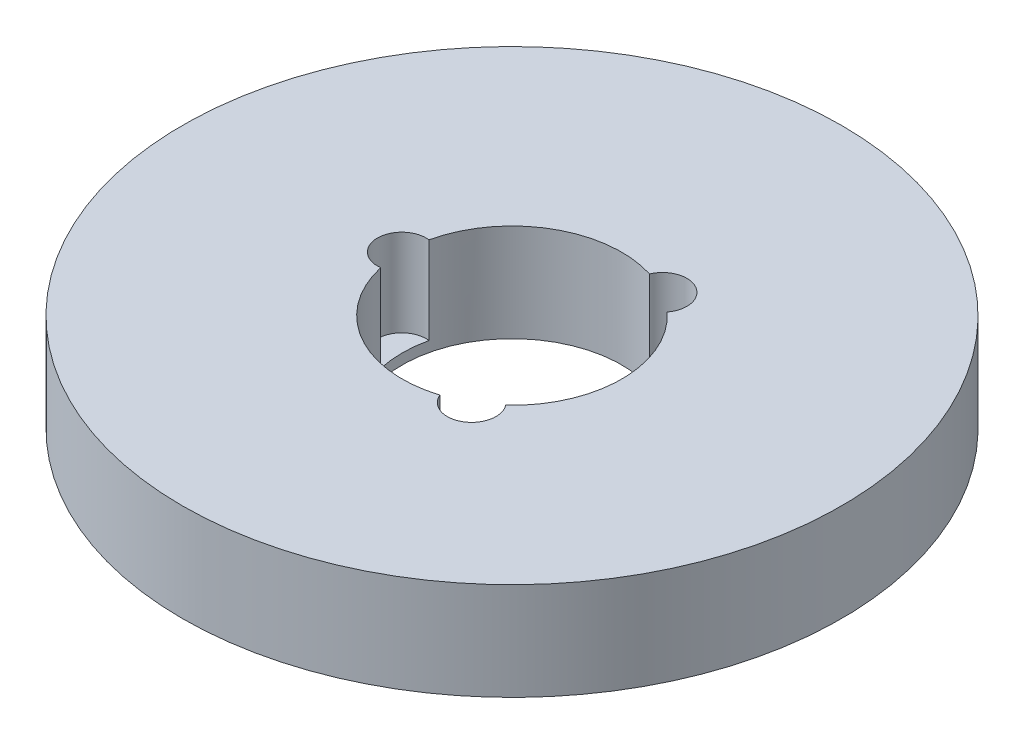
ISO-10303-21;
HEADER;
FILE_DESCRIPTION(('STEP AP214'),'2;1');
FILE_NAME('part.step','',(''),(''),'','','');
FILE_SCHEMA(('AUTOMOTIVE_DESIGN { 1 0 10303 214 1 1 1 1 }'));
ENDSEC;
DATA;
#1=APPLICATION_CONTEXT('core data for automotive mechanical design processes');
#2=APPLICATION_PROTOCOL_DEFINITION('international standard','automotive_design',2000,#1);
#3=PRODUCT_CONTEXT('',#1,'mechanical');
#4=PRODUCT('Part','Part','',(#3));
#5=PRODUCT_RELATED_PRODUCT_CATEGORY('part','',(#4));
#6=PRODUCT_DEFINITION_FORMATION('','',#4);
#7=PRODUCT_DEFINITION_CONTEXT('part definition',#1,'design');
#8=PRODUCT_DEFINITION('design','',#6,#7);
#9=PRODUCT_DEFINITION_SHAPE('','',#8);
#10=(LENGTH_UNIT() NAMED_UNIT(*) SI_UNIT(.MILLI.,.METRE.));
#11=(NAMED_UNIT(*) PLANE_ANGLE_UNIT() SI_UNIT($,.RADIAN.));
#12=(NAMED_UNIT(*) SI_UNIT($,.STERADIAN.) SOLID_ANGLE_UNIT());
#13=UNCERTAINTY_MEASURE_WITH_UNIT(LENGTH_MEASURE(1.E-05),#10,'distance_accuracy_value','');
#14=(GEOMETRIC_REPRESENTATION_CONTEXT(3) GLOBAL_UNCERTAINTY_ASSIGNED_CONTEXT((#13)) GLOBAL_UNIT_ASSIGNED_CONTEXT((#10,
#11,#12)) REPRESENTATION_CONTEXT('',''));
#15=CARTESIAN_POINT('',(0.,0.,0.));
#16=DIRECTION('',(0.,0.,1.));
#17=DIRECTION('',(1.,0.,0.));
#18=AXIS2_PLACEMENT_3D('',#15,#16,#17);
#19=CARTESIAN_POINT('',(0.,20.,0.));
#20=DIRECTION('',(0.,-1.,0.));
#21=DIRECTION('',(0.,0.,-1.));
#22=AXIS2_PLACEMENT_3D('',#19,#20,#21);
#23=CYLINDRICAL_SURFACE('',#22,67.5);
#24=CARTESIAN_POINT('',(0.,20.,0.));
#25=DIRECTION('',(0.,1.,0.));
#26=DIRECTION('',(0.,0.,1.));
#27=AXIS2_PLACEMENT_3D('',#24,#25,#26);
#28=CIRCLE('',#27,67.5);
#29=CARTESIAN_POINT('',(0.,20.,67.5));
#30=VERTEX_POINT('',#29);
#31=EDGE_CURVE('E126',#30,#30,#28,.T.);
#32=ORIENTED_EDGE('',*,*,#31,.F.);
#33=EDGE_LOOP('',(#32));
#34=FACE_BOUND('',#33,.T.);
#35=CARTESIAN_POINT('',(0.,0.,0.));
#36=DIRECTION('',(0.,1.,0.));
#37=DIRECTION('',(0.,0.,1.));
#38=AXIS2_PLACEMENT_3D('',#35,#36,#37);
#39=CIRCLE('',#38,67.5);
#40=CARTESIAN_POINT('',(0.,0.,67.5));
#41=VERTEX_POINT('',#40);
#42=EDGE_CURVE('E124',#41,#41,#39,.T.);
#43=ORIENTED_EDGE('',*,*,#42,.T.);
#44=EDGE_LOOP('',(#43));
#45=FACE_BOUND('',#44,.T.);
#46=ADVANCED_FACE('F39',(#34,#45),#23,.T.);
#47=CARTESIAN_POINT('',(0.,20.,0.));
#48=DIRECTION('',(0.,1.,0.));
#49=DIRECTION('',(0.,0.,1.));
#50=AXIS2_PLACEMENT_3D('',#47,#48,#49);
#51=PLANE('',#50);
#52=CARTESIAN_POINT('',(11.2860445841063,20.,19.5480026361594));
#53=DIRECTION('',(0.,1.,0.));
#54=DIRECTION('',(0.866025403784436,0.,-0.500000000000004));
#55=AXIS2_PLACEMENT_3D('',#52,#53,#54);
#56=CIRCLE('',#55,4.98301642811291);
#57=CARTESIAN_POINT('',(6.69337723398532,20.,21.4813570614979));
#58=VERTEX_POINT('',#57);
#59=CARTESIAN_POINT('',(15.2567123060289,20.,16.5373132524925));
#60=VERTEX_POINT('',#59);
#61=EDGE_CURVE('E147',#58,#60,#56,.T.);
#62=ORIENTED_EDGE('',*,*,#61,.F.);
#63=CARTESIAN_POINT('',(0.,20.,0.));
#64=DIRECTION('',(0.,1.,0.));
#65=DIRECTION('',(0.,0.,1.));
#66=AXIS2_PLACEMENT_3D('',#63,#64,#65);
#67=CIRCLE('',#66,22.5);
#68=CARTESIAN_POINT('',(-21.9500895400141,20.,4.94404380900537));
#69=VERTEX_POINT('',#68);
#70=EDGE_CURVE('E118',#69,#58,#67,.T.);
#71=ORIENTED_EDGE('',*,*,#70,.F.);
#72=CARTESIAN_POINT('',(-22.5720891682124,20.,0.));
#73=DIRECTION('',(0.,1.,0.));
#74=DIRECTION('',(0.,0.,1.));
#75=AXIS2_PLACEMENT_3D('',#72,#73,#74);
#76=CIRCLE('',#75,4.98301642811291);
#77=CARTESIAN_POINT('',(-21.9500895400141,20.,-4.94404380900537));
#78=VERTEX_POINT('',#77);
#79=EDGE_CURVE('E113',#78,#69,#76,.T.);
#80=ORIENTED_EDGE('',*,*,#79,.F.);
#81=CARTESIAN_POINT('',(6.69337723398502,20.,-21.481357061498));
#82=VERTEX_POINT('',#81);
#83=EDGE_CURVE('E106',#82,#78,#67,.T.);
#84=ORIENTED_EDGE('',*,*,#83,.F.);
#85=CARTESIAN_POINT('',(11.286044584106,20.,-19.5480026361596));
#86=DIRECTION('',(0.,1.,0.));
#87=DIRECTION('',(-0.866025403784443,0.,-0.499999999999992));
#88=AXIS2_PLACEMENT_3D('',#85,#86,#87);
#89=CIRCLE('',#88,4.98301642811291);
#90=CARTESIAN_POINT('',(15.2567123060287,20.,-16.5373132524927));
#91=VERTEX_POINT('',#90);
#92=EDGE_CURVE('E90',#91,#82,#89,.T.);
#93=ORIENTED_EDGE('',*,*,#92,.F.);
#94=EDGE_CURVE('E116',#60,#91,#67,.T.);
#95=ORIENTED_EDGE('',*,*,#94,.F.);
#96=EDGE_LOOP('',(#62,#71,#80,#84,#93,#95));
#97=FACE_BOUND('',#96,.T.);
#98=ORIENTED_EDGE('',*,*,#31,.T.);
#99=EDGE_LOOP('',(#98));
#100=FACE_BOUND('',#99,.T.);
#101=ADVANCED_FACE('F115',(#97,#100),#51,.T.);
#102=CARTESIAN_POINT('',(0.,0.,0.));
#103=DIRECTION('',(0.,1.,0.));
#104=DIRECTION('',(0.,0.,1.));
#105=AXIS2_PLACEMENT_3D('',#102,#103,#104);
#106=PLANE('',#105);
#107=CARTESIAN_POINT('',(0.,0.,0.));
#108=DIRECTION('',(0.,1.,0.));
#109=DIRECTION('',(0.,0.,1.));
#110=AXIS2_PLACEMENT_3D('',#107,#108,#109);
#111=CIRCLE('',#110,22.5);
#112=CARTESIAN_POINT('',(0.,0.,22.5));
#113=VERTEX_POINT('',#112);
#114=EDGE_CURVE('E120',#113,#113,#111,.T.);
#115=ORIENTED_EDGE('',*,*,#114,.T.);
#116=EDGE_LOOP('',(#115));
#117=FACE_BOUND('',#116,.T.);
#118=ORIENTED_EDGE('',*,*,#42,.F.);
#119=EDGE_LOOP('',(#118));
#120=FACE_BOUND('',#119,.T.);
#121=ADVANCED_FACE('F164',(#117,#120),#106,.F.);
#122=CARTESIAN_POINT('',(0.,20.,0.));
#123=DIRECTION('',(0.,-1.,0.));
#124=DIRECTION('',(0.,0.,-1.));
#125=AXIS2_PLACEMENT_3D('',#122,#123,#124);
#126=CYLINDRICAL_SURFACE('',#125,22.5);
#127=DIRECTION('',(0.,1.,0.));
#128=VECTOR('',#127,1.);
#129=CARTESIAN_POINT('',(6.69337723398532,11.0672994429792,21.4813570614979));
#130=LINE('',#129,#128);
#131=CARTESIAN_POINT('',(6.69337723398532,2.1345988859585,21.4813570614979));
#132=VERTEX_POINT('',#131);
#133=EDGE_CURVE('E11',#132,#58,#130,.T.);
#134=ORIENTED_EDGE('',*,*,#133,.F.);
#135=CARTESIAN_POINT('',(0.,2.1345988859585,0.));
#136=DIRECTION('',(0.,1.,0.));
#137=DIRECTION('',(0.,0.,1.));
#138=AXIS2_PLACEMENT_3D('',#135,#136,#137);
#139=CIRCLE('',#138,22.5);
#140=CARTESIAN_POINT('',(15.2567123060289,2.1345988859585,16.5373132524925));
#141=VERTEX_POINT('',#140);
#142=EDGE_CURVE('E144',#132,#141,#139,.T.);
#143=ORIENTED_EDGE('',*,*,#142,.T.);
#144=DIRECTION('',(0.,1.,0.));
#145=VECTOR('',#144,1.);
#146=CARTESIAN_POINT('',(15.2567123060289,11.0672994429792,16.5373132524925));
#147=LINE('',#146,#145);
#148=EDGE_CURVE('E46',#60,#141,#147,.F.);
#149=ORIENTED_EDGE('',*,*,#148,.F.);
#150=ORIENTED_EDGE('',*,*,#94,.T.);
#151=DIRECTION('',(0.,1.,0.));
#152=VECTOR('',#151,1.);
#153=CARTESIAN_POINT('',(15.2567123060287,11.0672994429792,-16.5373132524927));
#154=LINE('',#153,#152);
#155=CARTESIAN_POINT('',(15.2567123060287,2.1345988859585,-16.5373132524927));
#156=VERTEX_POINT('',#155);
#157=EDGE_CURVE('E92',#156,#91,#154,.T.);
#158=ORIENTED_EDGE('',*,*,#157,.F.);
#159=CARTESIAN_POINT('',(0.,2.1345988859585,0.));
#160=DIRECTION('',(0.,1.,0.));
#161=DIRECTION('',(0.,0.,1.));
#162=AXIS2_PLACEMENT_3D('',#159,#160,#161);
#163=CIRCLE('',#162,22.5);
#164=CARTESIAN_POINT('',(6.69337723398502,2.1345988859585,-21.481357061498));
#165=VERTEX_POINT('',#164);
#166=EDGE_CURVE('E107',#156,#165,#163,.T.);
#167=ORIENTED_EDGE('',*,*,#166,.T.);
#168=DIRECTION('',(0.,1.,0.));
#169=VECTOR('',#168,1.);
#170=CARTESIAN_POINT('',(6.69337723398502,11.0672994429792,-21.481357061498));
#171=LINE('',#170,#169);
#172=EDGE_CURVE('E95',#82,#165,#171,.F.);
#173=ORIENTED_EDGE('',*,*,#172,.F.);
#174=ORIENTED_EDGE('',*,*,#83,.T.);
#175=DIRECTION('',(0.,1.,0.));
#176=VECTOR('',#175,1.);
#177=CARTESIAN_POINT('',(-21.9500895400141,11.0672994429792,-4.94404380900537));
#178=LINE('',#177,#176);
#179=CARTESIAN_POINT('',(-21.9500895400141,2.1345988859585,-4.94404380900537));
#180=VERTEX_POINT('',#179);
#181=EDGE_CURVE('E143',#180,#78,#178,.T.);
#182=ORIENTED_EDGE('',*,*,#181,.F.);
#183=CARTESIAN_POINT('',(0.,2.1345988859585,0.));
#184=DIRECTION('',(0.,1.,0.));
#185=DIRECTION('',(0.,0.,1.));
#186=AXIS2_PLACEMENT_3D('',#183,#184,#185);
#187=CIRCLE('',#186,22.5);
#188=CARTESIAN_POINT('',(-21.9500895400141,2.1345988859585,4.94404380900537));
#189=VERTEX_POINT('',#188);
#190=EDGE_CURVE('E132',#180,#189,#187,.T.);
#191=ORIENTED_EDGE('',*,*,#190,.T.);
#192=DIRECTION('',(0.,1.,0.));
#193=VECTOR('',#192,1.);
#194=CARTESIAN_POINT('',(-21.9500895400141,11.0672994429792,4.94404380900537));
#195=LINE('',#194,#193);
#196=EDGE_CURVE('E137',#69,#189,#195,.F.);
#197=ORIENTED_EDGE('',*,*,#196,.F.);
#198=ORIENTED_EDGE('',*,*,#70,.T.);
#199=EDGE_LOOP('',(#134,#143,#149,#150,#158,#167,#173,#174,#182,#191,#197,#198));
#200=FACE_BOUND('',#199,.T.);
#201=ORIENTED_EDGE('',*,*,#114,.F.);
#202=EDGE_LOOP('',(#201));
#203=FACE_BOUND('',#202,.T.);
#204=ADVANCED_FACE('F103',(#200,#203),#126,.F.);
#205=CARTESIAN_POINT('',(-22.5720891682124,2.1345988859585,0.));
#206=DIRECTION('',(0.,1.,0.));
#207=DIRECTION('',(0.,0.,1.));
#208=AXIS2_PLACEMENT_3D('',#205,#206,#207);
#209=CYLINDRICAL_SURFACE('',#208,4.98301642811291);
#210=ORIENTED_EDGE('',*,*,#181,.T.);
#211=ORIENTED_EDGE('',*,*,#79,.T.);
#212=ORIENTED_EDGE('',*,*,#196,.T.);
#213=CARTESIAN_POINT('',(-22.5720891682124,2.1345988859585,0.));
#214=DIRECTION('',(0.,1.,0.));
#215=DIRECTION('',(0.,0.,1.));
#216=AXIS2_PLACEMENT_3D('',#213,#214,#215);
#217=CIRCLE('',#216,4.98301642811291);
#218=EDGE_CURVE('E121',#180,#189,#217,.T.);
#219=ORIENTED_EDGE('',*,*,#218,.F.);
#220=EDGE_LOOP('',(#210,#211,#212,#219));
#221=FACE_BOUND('',#220,.T.);
#222=ADVANCED_FACE('F174',(#221),#209,.F.);
#223=CARTESIAN_POINT('',(-22.5720891682124,2.1345988859585,0.));
#224=DIRECTION('',(0.,1.,0.));
#225=DIRECTION('',(0.,0.,1.));
#226=AXIS2_PLACEMENT_3D('',#223,#224,#225);
#227=PLANE('',#226);
#228=ORIENTED_EDGE('',*,*,#218,.T.);
#229=ORIENTED_EDGE('',*,*,#190,.F.);
#230=EDGE_LOOP('',(#228,#229));
#231=FACE_BOUND('',#230,.T.);
#232=ADVANCED_FACE('F177',(#231),#227,.T.);
#233=CARTESIAN_POINT('',(11.286044584106,2.1345988859585,-19.5480026361596));
#234=DIRECTION('',(0.,1.,0.));
#235=DIRECTION('',(0.,0.,1.));
#236=AXIS2_PLACEMENT_3D('',#233,#234,#235);
#237=CYLINDRICAL_SURFACE('',#236,4.98301642811291);
#238=ORIENTED_EDGE('',*,*,#157,.T.);
#239=ORIENTED_EDGE('',*,*,#92,.T.);
#240=ORIENTED_EDGE('',*,*,#172,.T.);
#241=CARTESIAN_POINT('',(11.286044584106,2.1345988859585,-19.5480026361596));
#242=DIRECTION('',(0.,1.,0.));
#243=DIRECTION('',(-0.866025403784443,0.,-0.499999999999992));
#244=AXIS2_PLACEMENT_3D('',#241,#242,#243);
#245=CIRCLE('',#244,4.98301642811291);
#246=EDGE_CURVE('E56',#156,#165,#245,.T.);
#247=ORIENTED_EDGE('',*,*,#246,.F.);
#248=EDGE_LOOP('',(#238,#239,#240,#247));
#249=FACE_BOUND('',#248,.T.);
#250=ADVANCED_FACE('F93',(#249),#237,.F.);
#251=CARTESIAN_POINT('',(11.286044584106,2.1345988859585,-19.5480026361596));
#252=DIRECTION('',(0.,1.,0.));
#253=DIRECTION('',(-0.866025403784443,0.,-0.499999999999992));
#254=AXIS2_PLACEMENT_3D('',#251,#252,#253);
#255=PLANE('',#254);
#256=ORIENTED_EDGE('',*,*,#246,.T.);
#257=ORIENTED_EDGE('',*,*,#166,.F.);
#258=EDGE_LOOP('',(#256,#257));
#259=FACE_BOUND('',#258,.T.);
#260=ADVANCED_FACE('F160',(#259),#255,.T.);
#261=CARTESIAN_POINT('',(11.2860445841063,2.1345988859585,19.5480026361594));
#262=DIRECTION('',(0.,1.,0.));
#263=DIRECTION('',(0.,0.,1.));
#264=AXIS2_PLACEMENT_3D('',#261,#262,#263);
#265=CYLINDRICAL_SURFACE('',#264,4.98301642811291);
#266=ORIENTED_EDGE('',*,*,#133,.T.);
#267=ORIENTED_EDGE('',*,*,#61,.T.);
#268=ORIENTED_EDGE('',*,*,#148,.T.);
#269=CARTESIAN_POINT('',(11.2860445841063,2.1345988859585,19.5480026361594));
#270=DIRECTION('',(0.,1.,0.));
#271=DIRECTION('',(0.866025403784436,0.,-0.500000000000004));
#272=AXIS2_PLACEMENT_3D('',#269,#270,#271);
#273=CIRCLE('',#272,4.98301642811291);
#274=EDGE_CURVE('E55',#132,#141,#273,.T.);
#275=ORIENTED_EDGE('',*,*,#274,.F.);
#276=EDGE_LOOP('',(#266,#267,#268,#275));
#277=FACE_BOUND('',#276,.T.);
#278=ADVANCED_FACE('F149',(#277),#265,.F.);
#279=CARTESIAN_POINT('',(11.2860445841063,2.1345988859585,19.5480026361594));
#280=DIRECTION('',(0.,1.,0.));
#281=DIRECTION('',(0.866025403784436,0.,-0.500000000000004));
#282=AXIS2_PLACEMENT_3D('',#279,#280,#281);
#283=PLANE('',#282);
#284=ORIENTED_EDGE('',*,*,#274,.T.);
#285=ORIENTED_EDGE('',*,*,#142,.F.);
#286=EDGE_LOOP('',(#284,#285));
#287=FACE_BOUND('',#286,.T.);
#288=ADVANCED_FACE('F151',(#287),#283,.T.);
#289=CLOSED_SHELL('',(#46,#101,#121,#204,#222,#232,#250,#260,#278,#288));
#290=MANIFOLD_SOLID_BREP('B2',#289);
#291=ADVANCED_BREP_SHAPE_REPRESENTATION('',(#18,#290),#14);
#292=SHAPE_DEFINITION_REPRESENTATION(#9,#291);
ENDSEC;
END-ISO-10303-21;
